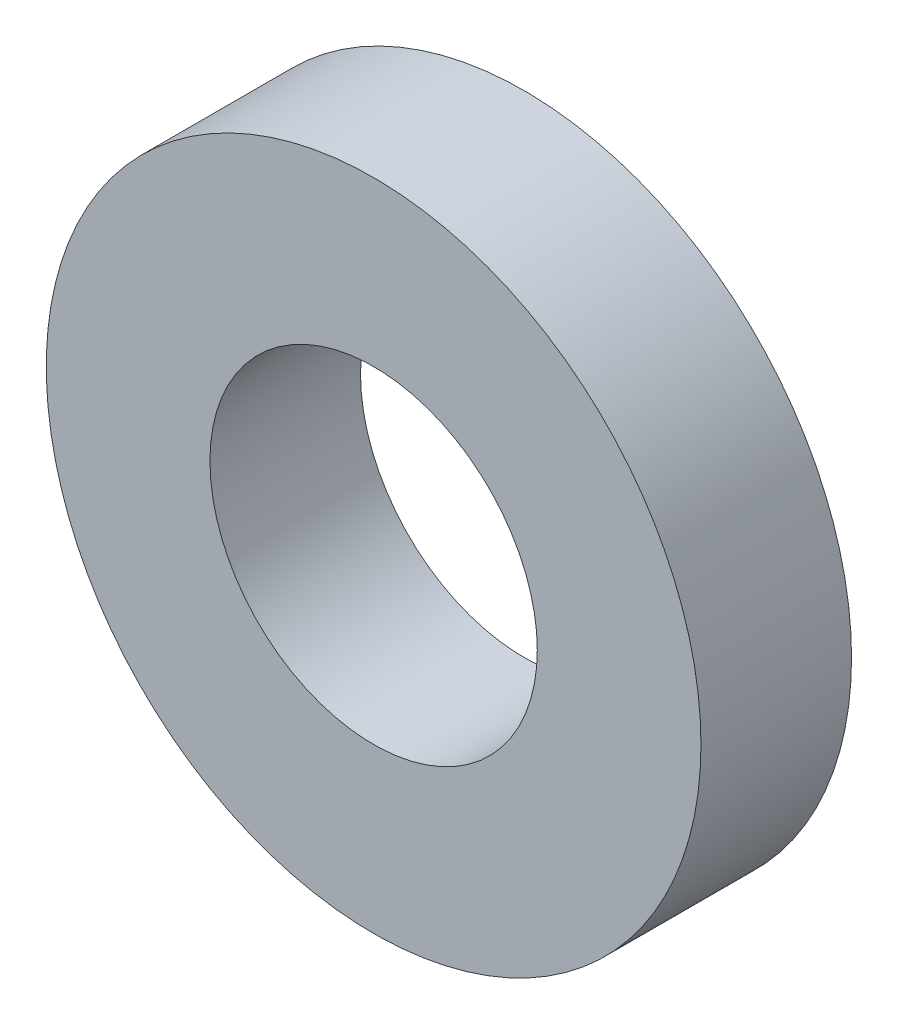
ISO-10303-21;
HEADER;
FILE_DESCRIPTION(('STEP AP214'),'2;1');
FILE_NAME('part.step','',(''),(''),'','','');
FILE_SCHEMA(('AUTOMOTIVE_DESIGN { 1 0 10303 214 1 1 1 1 }'));
ENDSEC;
DATA;
#1=APPLICATION_CONTEXT('core data for automotive mechanical design processes');
#2=APPLICATION_PROTOCOL_DEFINITION('international standard','automotive_design',2000,#1);
#3=PRODUCT_CONTEXT('',#1,'mechanical');
#4=PRODUCT('Part','Part','',(#3));
#5=PRODUCT_RELATED_PRODUCT_CATEGORY('part','',(#4));
#6=PRODUCT_DEFINITION_FORMATION('','',#4);
#7=PRODUCT_DEFINITION_CONTEXT('part definition',#1,'design');
#8=PRODUCT_DEFINITION('design','',#6,#7);
#9=PRODUCT_DEFINITION_SHAPE('','',#8);
#10=(LENGTH_UNIT() NAMED_UNIT(*) SI_UNIT(.MILLI.,.METRE.));
#11=(NAMED_UNIT(*) PLANE_ANGLE_UNIT() SI_UNIT($,.RADIAN.));
#12=(NAMED_UNIT(*) SI_UNIT($,.STERADIAN.) SOLID_ANGLE_UNIT());
#13=UNCERTAINTY_MEASURE_WITH_UNIT(LENGTH_MEASURE(1.E-05),#10,'distance_accuracy_value','');
#14=(GEOMETRIC_REPRESENTATION_CONTEXT(3) GLOBAL_UNCERTAINTY_ASSIGNED_CONTEXT((#13)) GLOBAL_UNIT_ASSIGNED_CONTEXT((#10,
#11,#12)) REPRESENTATION_CONTEXT('',''));
#15=CARTESIAN_POINT('',(0.,0.,0.));
#16=DIRECTION('',(0.,0.,1.));
#17=DIRECTION('',(1.,0.,0.));
#18=AXIS2_PLACEMENT_3D('',#15,#16,#17);
#19=CARTESIAN_POINT('',(0.,0.,1.38));
#20=DIRECTION('',(0.,0.,1.));
#21=DIRECTION('',(1.,0.,0.));
#22=AXIS2_PLACEMENT_3D('',#19,#20,#21);
#23=PLANE('',#22);
#24=CARTESIAN_POINT('',(0.,0.,1.38));
#25=DIRECTION('',(0.,0.,1.));
#26=DIRECTION('',(1.,0.,0.));
#27=AXIS2_PLACEMENT_3D('',#24,#25,#26);
#28=CIRCLE('',#27,3.);
#29=CARTESIAN_POINT('',(3.,0.,1.38));
#30=VERTEX_POINT('',#29);
#31=EDGE_CURVE('E10',#30,#30,#28,.T.);
#32=ORIENTED_EDGE('',*,*,#31,.T.);
#33=EDGE_LOOP('',(#32));
#34=FACE_BOUND('',#33,.T.);
#35=CARTESIAN_POINT('',(0.,0.,1.38));
#36=DIRECTION('',(0.,0.,1.));
#37=DIRECTION('',(1.,0.,0.));
#38=AXIS2_PLACEMENT_3D('',#35,#36,#37);
#39=CIRCLE('',#38,1.5);
#40=CARTESIAN_POINT('',(1.5,0.,1.38));
#41=VERTEX_POINT('',#40);
#42=EDGE_CURVE('E43',#41,#41,#39,.T.);
#43=ORIENTED_EDGE('',*,*,#42,.F.);
#44=EDGE_LOOP('',(#43));
#45=FACE_BOUND('',#44,.T.);
#46=ADVANCED_FACE('F32',(#34,#45),#23,.T.);
#47=CARTESIAN_POINT('',(0.,0.,0.));
#48=DIRECTION('',(0.,0.,1.));
#49=DIRECTION('',(1.,0.,0.));
#50=AXIS2_PLACEMENT_3D('',#47,#48,#49);
#51=PLANE('',#50);
#52=CARTESIAN_POINT('',(0.,0.,0.));
#53=DIRECTION('',(0.,0.,1.));
#54=DIRECTION('',(1.,0.,0.));
#55=AXIS2_PLACEMENT_3D('',#52,#53,#54);
#56=CIRCLE('',#55,3.);
#57=CARTESIAN_POINT('',(3.,0.,0.));
#58=VERTEX_POINT('',#57);
#59=EDGE_CURVE('E36',#58,#58,#56,.T.);
#60=ORIENTED_EDGE('',*,*,#59,.F.);
#61=EDGE_LOOP('',(#60));
#62=FACE_BOUND('',#61,.T.);
#63=CARTESIAN_POINT('',(0.,0.,0.));
#64=DIRECTION('',(0.,0.,1.));
#65=DIRECTION('',(1.,0.,0.));
#66=AXIS2_PLACEMENT_3D('',#63,#64,#65);
#67=CIRCLE('',#66,1.5);
#68=CARTESIAN_POINT('',(1.5,0.,0.));
#69=VERTEX_POINT('',#68);
#70=EDGE_CURVE('E45',#69,#69,#67,.T.);
#71=ORIENTED_EDGE('',*,*,#70,.T.);
#72=EDGE_LOOP('',(#71));
#73=FACE_BOUND('',#72,.T.);
#74=ADVANCED_FACE('F55',(#62,#73),#51,.F.);
#75=CARTESIAN_POINT('',(0.,0.,1.38));
#76=DIRECTION('',(0.,0.,-1.));
#77=DIRECTION('',(-1.,0.,0.));
#78=AXIS2_PLACEMENT_3D('',#75,#76,#77);
#79=CYLINDRICAL_SURFACE('',#78,3.);
#80=ORIENTED_EDGE('',*,*,#31,.F.);
#81=EDGE_LOOP('',(#80));
#82=FACE_BOUND('',#81,.T.);
#83=ORIENTED_EDGE('',*,*,#59,.T.);
#84=EDGE_LOOP('',(#83));
#85=FACE_BOUND('',#84,.T.);
#86=ADVANCED_FACE('F34',(#82,#85),#79,.T.);
#87=CARTESIAN_POINT('',(0.,0.,1.38));
#88=DIRECTION('',(0.,0.,-1.));
#89=DIRECTION('',(-1.,0.,0.));
#90=AXIS2_PLACEMENT_3D('',#87,#88,#89);
#91=CYLINDRICAL_SURFACE('',#90,1.5);
#92=ORIENTED_EDGE('',*,*,#42,.T.);
#93=EDGE_LOOP('',(#92));
#94=FACE_BOUND('',#93,.T.);
#95=ORIENTED_EDGE('',*,*,#70,.F.);
#96=EDGE_LOOP('',(#95));
#97=FACE_BOUND('',#96,.T.);
#98=ADVANCED_FACE('F51',(#94,#97),#91,.F.);
#99=CLOSED_SHELL('',(#46,#74,#86,#98));
#100=MANIFOLD_SOLID_BREP('B2',#99);
#101=ADVANCED_BREP_SHAPE_REPRESENTATION('',(#18,#100),#14);
#102=SHAPE_DEFINITION_REPRESENTATION(#9,#101);
ENDSEC;
END-ISO-10303-21;
